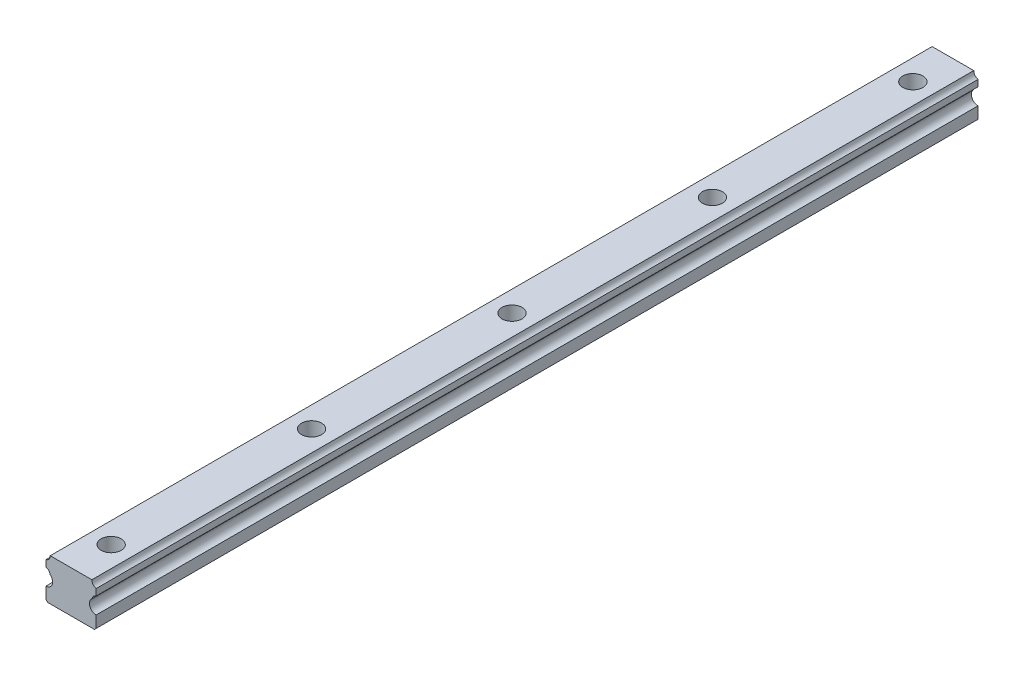
ISO-10303-21;
HEADER;
FILE_DESCRIPTION(('STEP AP214'),'2;1');
FILE_NAME('part.step','',(''),(''),'','','');
FILE_SCHEMA(('AUTOMOTIVE_DESIGN { 1 0 10303 214 1 1 1 1 }'));
ENDSEC;
DATA;
#1=APPLICATION_CONTEXT('core data for automotive mechanical design processes');
#2=APPLICATION_PROTOCOL_DEFINITION('international standard','automotive_design',2000,#1);
#3=PRODUCT_CONTEXT('',#1,'mechanical');
#4=PRODUCT('Part','Part','',(#3));
#5=PRODUCT_RELATED_PRODUCT_CATEGORY('part','',(#4));
#6=PRODUCT_DEFINITION_FORMATION('','',#4);
#7=PRODUCT_DEFINITION_CONTEXT('part definition',#1,'design');
#8=PRODUCT_DEFINITION('design','',#6,#7);
#9=PRODUCT_DEFINITION_SHAPE('','',#8);
#10=(LENGTH_UNIT() NAMED_UNIT(*) SI_UNIT(.MILLI.,.METRE.));
#11=(NAMED_UNIT(*) PLANE_ANGLE_UNIT() SI_UNIT($,.RADIAN.));
#12=(NAMED_UNIT(*) SI_UNIT($,.STERADIAN.) SOLID_ANGLE_UNIT());
#13=UNCERTAINTY_MEASURE_WITH_UNIT(LENGTH_MEASURE(1.E-05),#10,'distance_accuracy_value','');
#14=(GEOMETRIC_REPRESENTATION_CONTEXT(3) GLOBAL_UNCERTAINTY_ASSIGNED_CONTEXT((#13)) GLOBAL_UNIT_ASSIGNED_CONTEXT((#10,
#11,#12)) REPRESENTATION_CONTEXT('',''));
#15=CARTESIAN_POINT('',(0.,0.,0.));
#16=DIRECTION('',(0.,0.,1.));
#17=DIRECTION('',(1.,0.,0.));
#18=AXIS2_PLACEMENT_3D('',#15,#16,#17);
#19=CARTESIAN_POINT('',(0.,10.25,-60.));
#20=DIRECTION('',(0.,-1.,0.));
#21=DIRECTION('',(0.,0.,-1.));
#22=AXIS2_PLACEMENT_3D('',#19,#20,#21);
#23=CYLINDRICAL_SURFACE('',#22,3.);
#24=CARTESIAN_POINT('',(0.,12.5,-60.));
#25=DIRECTION('',(0.,-1.,0.));
#26=DIRECTION('',(0.,0.,-1.));
#27=AXIS2_PLACEMENT_3D('',#24,#25,#26);
#28=CIRCLE('',#27,3.);
#29=CARTESIAN_POINT('',(0.,12.5,-63.));
#30=VERTEX_POINT('',#29);
#31=EDGE_CURVE('E178',#30,#30,#28,.T.);
#32=ORIENTED_EDGE('',*,*,#31,.F.);
#33=EDGE_LOOP('',(#32));
#34=FACE_BOUND('',#33,.T.);
#35=CARTESIAN_POINT('',(0.,8.,-60.));
#36=DIRECTION('',(0.,-1.,0.));
#37=DIRECTION('',(0.,0.,-1.));
#38=AXIS2_PLACEMENT_3D('',#35,#36,#37);
#39=CIRCLE('',#38,3.);
#40=CARTESIAN_POINT('',(0.,8.,-63.));
#41=VERTEX_POINT('',#40);
#42=EDGE_CURVE('E20',#41,#41,#39,.T.);
#43=ORIENTED_EDGE('',*,*,#42,.T.);
#44=EDGE_LOOP('',(#43));
#45=FACE_BOUND('',#44,.T.);
#46=ADVANCED_FACE('F17',(#34,#45),#23,.F.);
#47=CARTESIAN_POINT('',(0.,10.25,0.));
#48=DIRECTION('',(0.,-1.,0.));
#49=DIRECTION('',(0.,0.,-1.));
#50=AXIS2_PLACEMENT_3D('',#47,#48,#49);
#51=CYLINDRICAL_SURFACE('',#50,3.);
#52=CARTESIAN_POINT('',(0.,12.5,0.));
#53=DIRECTION('',(0.,-1.,0.));
#54=DIRECTION('',(0.,0.,-1.));
#55=AXIS2_PLACEMENT_3D('',#52,#53,#54);
#56=CIRCLE('',#55,3.);
#57=CARTESIAN_POINT('',(0.,12.5,-3.));
#58=VERTEX_POINT('',#57);
#59=EDGE_CURVE('E175',#58,#58,#56,.T.);
#60=ORIENTED_EDGE('',*,*,#59,.F.);
#61=EDGE_LOOP('',(#60));
#62=FACE_BOUND('',#61,.T.);
#63=CARTESIAN_POINT('',(0.,8.,0.));
#64=DIRECTION('',(0.,-1.,0.));
#65=DIRECTION('',(0.,0.,-1.));
#66=AXIS2_PLACEMENT_3D('',#63,#64,#65);
#67=CIRCLE('',#66,3.);
#68=CARTESIAN_POINT('',(0.,8.,-3.));
#69=VERTEX_POINT('',#68);
#70=EDGE_CURVE('E190',#69,#69,#67,.T.);
#71=ORIENTED_EDGE('',*,*,#70,.T.);
#72=EDGE_LOOP('',(#71));
#73=FACE_BOUND('',#72,.T.);
#74=ADVANCED_FACE('F314',(#62,#73),#51,.F.);
#75=CARTESIAN_POINT('',(0.,10.25,60.));
#76=DIRECTION('',(0.,-1.,0.));
#77=DIRECTION('',(0.,0.,-1.));
#78=AXIS2_PLACEMENT_3D('',#75,#76,#77);
#79=CYLINDRICAL_SURFACE('',#78,3.);
#80=CARTESIAN_POINT('',(0.,12.5,60.));
#81=DIRECTION('',(0.,-1.,0.));
#82=DIRECTION('',(0.,0.,-1.));
#83=AXIS2_PLACEMENT_3D('',#80,#81,#82);
#84=CIRCLE('',#83,3.);
#85=CARTESIAN_POINT('',(0.,12.5,57.));
#86=VERTEX_POINT('',#85);
#87=EDGE_CURVE('E172',#86,#86,#84,.T.);
#88=ORIENTED_EDGE('',*,*,#87,.F.);
#89=EDGE_LOOP('',(#88));
#90=FACE_BOUND('',#89,.T.);
#91=CARTESIAN_POINT('',(0.,8.,60.));
#92=DIRECTION('',(0.,-1.,0.));
#93=DIRECTION('',(0.,0.,-1.));
#94=AXIS2_PLACEMENT_3D('',#91,#92,#93);
#95=CIRCLE('',#94,3.);
#96=CARTESIAN_POINT('',(0.,8.,57.));
#97=VERTEX_POINT('',#96);
#98=EDGE_CURVE('E188',#97,#97,#95,.T.);
#99=ORIENTED_EDGE('',*,*,#98,.T.);
#100=EDGE_LOOP('',(#99));
#101=FACE_BOUND('',#100,.T.);
#102=ADVANCED_FACE('F312',(#90,#101),#79,.F.);
#103=CARTESIAN_POINT('',(0.,10.25,120.));
#104=DIRECTION('',(0.,-1.,0.));
#105=DIRECTION('',(0.,0.,-1.));
#106=AXIS2_PLACEMENT_3D('',#103,#104,#105);
#107=CYLINDRICAL_SURFACE('',#106,3.);
#108=CARTESIAN_POINT('',(0.,12.5,120.));
#109=DIRECTION('',(0.,-1.,0.));
#110=DIRECTION('',(0.,0.,-1.));
#111=AXIS2_PLACEMENT_3D('',#108,#109,#110);
#112=CIRCLE('',#111,3.);
#113=CARTESIAN_POINT('',(0.,12.5,117.));
#114=VERTEX_POINT('',#113);
#115=EDGE_CURVE('E169',#114,#114,#112,.T.);
#116=ORIENTED_EDGE('',*,*,#115,.F.);
#117=EDGE_LOOP('',(#116));
#118=FACE_BOUND('',#117,.T.);
#119=CARTESIAN_POINT('',(0.,8.,120.));
#120=DIRECTION('',(0.,-1.,0.));
#121=DIRECTION('',(0.,0.,-1.));
#122=AXIS2_PLACEMENT_3D('',#119,#120,#121);
#123=CIRCLE('',#122,3.);
#124=CARTESIAN_POINT('',(0.,8.,117.));
#125=VERTEX_POINT('',#124);
#126=EDGE_CURVE('E185',#125,#125,#123,.T.);
#127=ORIENTED_EDGE('',*,*,#126,.T.);
#128=EDGE_LOOP('',(#127));
#129=FACE_BOUND('',#128,.T.);
#130=ADVANCED_FACE('F212',(#118,#129),#107,.F.);
#131=CARTESIAN_POINT('',(0.,10.25,-120.));
#132=DIRECTION('',(0.,-1.,0.));
#133=DIRECTION('',(0.,0.,-1.));
#134=AXIS2_PLACEMENT_3D('',#131,#132,#133);
#135=CYLINDRICAL_SURFACE('',#134,3.);
#136=CARTESIAN_POINT('',(0.,12.5,-120.));
#137=DIRECTION('',(0.,-1.,0.));
#138=DIRECTION('',(0.,0.,-1.));
#139=AXIS2_PLACEMENT_3D('',#136,#137,#138);
#140=CIRCLE('',#139,3.);
#141=CARTESIAN_POINT('',(0.,12.5,-123.));
#142=VERTEX_POINT('',#141);
#143=EDGE_CURVE('E165',#142,#142,#140,.T.);
#144=ORIENTED_EDGE('',*,*,#143,.F.);
#145=EDGE_LOOP('',(#144));
#146=FACE_BOUND('',#145,.T.);
#147=CARTESIAN_POINT('',(0.,8.,-120.));
#148=DIRECTION('',(0.,-1.,0.));
#149=DIRECTION('',(0.,0.,-1.));
#150=AXIS2_PLACEMENT_3D('',#147,#148,#149);
#151=CIRCLE('',#150,3.);
#152=CARTESIAN_POINT('',(0.,8.,-123.));
#153=VERTEX_POINT('',#152);
#154=EDGE_CURVE('E182',#153,#153,#151,.T.);
#155=ORIENTED_EDGE('',*,*,#154,.T.);
#156=EDGE_LOOP('',(#155));
#157=FACE_BOUND('',#156,.T.);
#158=ADVANCED_FACE('F201',(#146,#157),#135,.F.);
#159=CARTESIAN_POINT('',(0.,8.,-62.375));
#160=DIRECTION('',(0.,-1.,0.));
#161=DIRECTION('',(0.,0.,-1.));
#162=AXIS2_PLACEMENT_3D('',#159,#160,#161);
#163=PLANE('',#162);
#164=CARTESIAN_POINT('',(0.,8.,-60.));
#165=DIRECTION('',(0.,-1.,0.));
#166=DIRECTION('',(0.,0.,-1.));
#167=AXIS2_PLACEMENT_3D('',#164,#165,#166);
#168=CIRCLE('',#167,1.75);
#169=CARTESIAN_POINT('',(0.,8.,-61.75));
#170=VERTEX_POINT('',#169);
#171=EDGE_CURVE('E161',#170,#170,#168,.T.);
#172=ORIENTED_EDGE('',*,*,#171,.T.);
#173=EDGE_LOOP('',(#172));
#174=FACE_BOUND('',#173,.T.);
#175=ORIENTED_EDGE('',*,*,#42,.F.);
#176=EDGE_LOOP('',(#175));
#177=FACE_BOUND('',#176,.T.);
#178=ADVANCED_FACE('F198',(#174,#177),#163,.F.);
#179=CARTESIAN_POINT('',(0.,8.,-2.375));
#180=DIRECTION('',(0.,-1.,0.));
#181=DIRECTION('',(0.,0.,-1.));
#182=AXIS2_PLACEMENT_3D('',#179,#180,#181);
#183=PLANE('',#182);
#184=CARTESIAN_POINT('',(0.,8.,0.));
#185=DIRECTION('',(0.,-1.,0.));
#186=DIRECTION('',(0.,0.,-1.));
#187=AXIS2_PLACEMENT_3D('',#184,#185,#186);
#188=CIRCLE('',#187,1.75);
#189=CARTESIAN_POINT('',(0.,8.,-1.75));
#190=VERTEX_POINT('',#189);
#191=EDGE_CURVE('E158',#190,#190,#188,.T.);
#192=ORIENTED_EDGE('',*,*,#191,.T.);
#193=EDGE_LOOP('',(#192));
#194=FACE_BOUND('',#193,.T.);
#195=ORIENTED_EDGE('',*,*,#70,.F.);
#196=EDGE_LOOP('',(#195));
#197=FACE_BOUND('',#196,.T.);
#198=ADVANCED_FACE('F200',(#194,#197),#183,.F.);
#199=CARTESIAN_POINT('',(0.,8.,57.625));
#200=DIRECTION('',(0.,-1.,0.));
#201=DIRECTION('',(0.,0.,-1.));
#202=AXIS2_PLACEMENT_3D('',#199,#200,#201);
#203=PLANE('',#202);
#204=CARTESIAN_POINT('',(0.,8.,60.));
#205=DIRECTION('',(0.,-1.,0.));
#206=DIRECTION('',(0.,0.,-1.));
#207=AXIS2_PLACEMENT_3D('',#204,#205,#206);
#208=CIRCLE('',#207,1.75);
#209=CARTESIAN_POINT('',(0.,8.,58.25));
#210=VERTEX_POINT('',#209);
#211=EDGE_CURVE('E155',#210,#210,#208,.T.);
#212=ORIENTED_EDGE('',*,*,#211,.T.);
#213=EDGE_LOOP('',(#212));
#214=FACE_BOUND('',#213,.T.);
#215=ORIENTED_EDGE('',*,*,#98,.F.);
#216=EDGE_LOOP('',(#215));
#217=FACE_BOUND('',#216,.T.);
#218=ADVANCED_FACE('F209',(#214,#217),#203,.F.);
#219=CARTESIAN_POINT('',(0.,8.,117.625));
#220=DIRECTION('',(0.,-1.,0.));
#221=DIRECTION('',(0.,0.,-1.));
#222=AXIS2_PLACEMENT_3D('',#219,#220,#221);
#223=PLANE('',#222);
#224=CARTESIAN_POINT('',(0.,8.,120.));
#225=DIRECTION('',(0.,-1.,0.));
#226=DIRECTION('',(0.,0.,-1.));
#227=AXIS2_PLACEMENT_3D('',#224,#225,#226);
#228=CIRCLE('',#227,1.75);
#229=CARTESIAN_POINT('',(0.,8.,118.25));
#230=VERTEX_POINT('',#229);
#231=EDGE_CURVE('E152',#230,#230,#228,.T.);
#232=ORIENTED_EDGE('',*,*,#231,.T.);
#233=EDGE_LOOP('',(#232));
#234=FACE_BOUND('',#233,.T.);
#235=ORIENTED_EDGE('',*,*,#126,.F.);
#236=EDGE_LOOP('',(#235));
#237=FACE_BOUND('',#236,.T.);
#238=ADVANCED_FACE('F299',(#234,#237),#223,.F.);
#239=CARTESIAN_POINT('',(0.,8.,-122.375));
#240=DIRECTION('',(0.,-1.,0.));
#241=DIRECTION('',(0.,0.,-1.));
#242=AXIS2_PLACEMENT_3D('',#239,#240,#241);
#243=PLANE('',#242);
#244=CARTESIAN_POINT('',(0.,8.,-120.));
#245=DIRECTION('',(0.,-1.,0.));
#246=DIRECTION('',(0.,0.,-1.));
#247=AXIS2_PLACEMENT_3D('',#244,#245,#246);
#248=CIRCLE('',#247,1.75);
#249=CARTESIAN_POINT('',(0.,8.,-121.75));
#250=VERTEX_POINT('',#249);
#251=EDGE_CURVE('E149',#250,#250,#248,.T.);
#252=ORIENTED_EDGE('',*,*,#251,.T.);
#253=EDGE_LOOP('',(#252));
#254=FACE_BOUND('',#253,.T.);
#255=ORIENTED_EDGE('',*,*,#154,.F.);
#256=EDGE_LOOP('',(#255));
#257=FACE_BOUND('',#256,.T.);
#258=ADVANCED_FACE('F296',(#254,#257),#243,.F.);
#259=CARTESIAN_POINT('',(7.5,0.5,132.));
#260=DIRECTION('',(1.,0.,0.));
#261=DIRECTION('',(0.,0.,-1.));
#262=AXIS2_PLACEMENT_3D('',#259,#260,#261);
#263=PLANE('',#262);
#264=DIRECTION('',(0.,1.,0.));
#265=VECTOR('',#264,1.);
#266=CARTESIAN_POINT('',(7.5,0.,132.));
#267=LINE('',#266,#265);
#268=CARTESIAN_POINT('',(7.5,0.5,132.));
#269=VERTEX_POINT('',#268);
#270=CARTESIAN_POINT('',(7.5,4.,132.));
#271=VERTEX_POINT('',#270);
#272=EDGE_CURVE('E621',#269,#271,#267,.T.);
#273=ORIENTED_EDGE('',*,*,#272,.F.);
#274=DIRECTION('',(0.,0.,1.));
#275=VECTOR('',#274,1.);
#276=CARTESIAN_POINT('',(7.5,0.5,132.));
#277=LINE('',#276,#275);
#278=CARTESIAN_POINT('',(7.5,0.5,-132.));
#279=VERTEX_POINT('',#278);
#280=EDGE_CURVE('E623',#279,#269,#277,.T.);
#281=ORIENTED_EDGE('',*,*,#280,.F.);
#282=DIRECTION('',(0.,1.,0.));
#283=VECTOR('',#282,1.);
#284=CARTESIAN_POINT('',(7.5,0.,-132.));
#285=LINE('',#284,#283);
#286=CARTESIAN_POINT('',(7.5,4.,-132.));
#287=VERTEX_POINT('',#286);
#288=EDGE_CURVE('E114',#279,#287,#285,.T.);
#289=ORIENTED_EDGE('',*,*,#288,.T.);
#290=DIRECTION('',(0.,0.,1.));
#291=VECTOR('',#290,1.);
#292=CARTESIAN_POINT('',(7.5,4.,132.));
#293=LINE('',#292,#291);
#294=EDGE_CURVE('E125',#287,#271,#293,.T.);
#295=ORIENTED_EDGE('',*,*,#294,.T.);
#296=EDGE_LOOP('',(#273,#281,#289,#295));
#297=FACE_BOUND('',#296,.T.);
#298=ADVANCED_FACE('F293',(#297),#263,.T.);
#299=CARTESIAN_POINT('',(7.5,6.,132.));
#300=DIRECTION('',(0.,0.,1.));
#301=DIRECTION('',(1.,0.,0.));
#302=AXIS2_PLACEMENT_3D('',#299,#300,#301);
#303=CYLINDRICAL_SURFACE('',#302,2.);
#304=DIRECTION('',(0.,0.,1.));
#305=VECTOR('',#304,1.);
#306=CARTESIAN_POINT('',(6.25576432205405,7.56584723958832,132.));
#307=LINE('',#306,#305);
#308=CARTESIAN_POINT('',(6.25576432205405,7.56584723958832,-132.));
#309=VERTEX_POINT('',#308);
#310=CARTESIAN_POINT('',(6.25576432205405,7.56584723958832,132.));
#311=VERTEX_POINT('',#310);
#312=EDGE_CURVE('E123',#309,#311,#307,.T.);
#313=ORIENTED_EDGE('',*,*,#312,.T.);
#314=CARTESIAN_POINT('',(7.5,6.,132.));
#315=DIRECTION('',(0.,0.,1.));
#316=DIRECTION('',(1.,0.,0.));
#317=AXIS2_PLACEMENT_3D('',#314,#315,#316);
#318=CIRCLE('',#317,2.);
#319=EDGE_CURVE('E625',#271,#311,#318,.F.);
#320=ORIENTED_EDGE('',*,*,#319,.F.);
#321=ORIENTED_EDGE('',*,*,#294,.F.);
#322=CARTESIAN_POINT('',(7.5,6.,-132.));
#323=DIRECTION('',(0.,0.,1.));
#324=DIRECTION('',(1.,0.,0.));
#325=AXIS2_PLACEMENT_3D('',#322,#323,#324);
#326=CIRCLE('',#325,2.);
#327=EDGE_CURVE('E119',#287,#309,#326,.F.);
#328=ORIENTED_EDGE('',*,*,#327,.T.);
#329=EDGE_LOOP('',(#313,#320,#321,#328));
#330=FACE_BOUND('',#329,.T.);
#331=ADVANCED_FACE('F121',(#330),#303,.F.);
#332=CARTESIAN_POINT('',(7.93,7.271,132.));
#333=DIRECTION('',(0.,0.,1.));
#334=DIRECTION('',(1.,0.,0.));
#335=AXIS2_PLACEMENT_3D('',#332,#333,#334);
#336=CYLINDRICAL_SURFACE('',#335,1.7);
#337=DIRECTION('',(0.,0.,-1.));
#338=VECTOR('',#337,1.);
#339=CARTESIAN_POINT('',(7.5,8.91571882095391,132.));
#340=LINE('',#339,#338);
#341=CARTESIAN_POINT('',(7.5,8.91571882095391,132.));
#342=VERTEX_POINT('',#341);
#343=CARTESIAN_POINT('',(7.5,8.91571882095391,-132.));
#344=VERTEX_POINT('',#343);
#345=EDGE_CURVE('E136',#342,#344,#340,.T.);
#346=ORIENTED_EDGE('',*,*,#345,.F.);
#347=CARTESIAN_POINT('',(7.93,7.271,132.));
#348=DIRECTION('',(0.,0.,1.));
#349=DIRECTION('',(1.,0.,0.));
#350=AXIS2_PLACEMENT_3D('',#347,#348,#349);
#351=CIRCLE('',#350,1.7);
#352=EDGE_CURVE('E134',#311,#342,#351,.F.);
#353=ORIENTED_EDGE('',*,*,#352,.F.);
#354=ORIENTED_EDGE('',*,*,#312,.F.);
#355=CARTESIAN_POINT('',(7.93,7.271,-132.));
#356=DIRECTION('',(0.,0.,1.));
#357=DIRECTION('',(1.,0.,0.));
#358=AXIS2_PLACEMENT_3D('',#355,#356,#357);
#359=CIRCLE('',#358,1.7);
#360=EDGE_CURVE('E128',#309,#344,#359,.F.);
#361=ORIENTED_EDGE('',*,*,#360,.T.);
#362=EDGE_LOOP('',(#346,#353,#354,#361));
#363=FACE_BOUND('',#362,.T.);
#364=ADVANCED_FACE('F131',(#363),#336,.F.);
#365=CARTESIAN_POINT('',(7.5,8.91571882095391,132.));
#366=DIRECTION('',(1.,0.,0.));
#367=DIRECTION('',(0.,0.,-1.));
#368=AXIS2_PLACEMENT_3D('',#365,#366,#367);
#369=PLANE('',#368);
#370=DIRECTION('',(0.,1.,0.));
#371=VECTOR('',#370,1.);
#372=CARTESIAN_POINT('',(7.5,0.,132.));
#373=LINE('',#372,#371);
#374=CARTESIAN_POINT('',(7.5,10.8552811790461,132.));
#375=VERTEX_POINT('',#374);
#376=EDGE_CURVE('E691',#342,#375,#373,.T.);
#377=ORIENTED_EDGE('',*,*,#376,.F.);
#378=ORIENTED_EDGE('',*,*,#345,.T.);
#379=DIRECTION('',(0.,1.,0.));
#380=VECTOR('',#379,1.);
#381=CARTESIAN_POINT('',(7.5,0.,-132.));
#382=LINE('',#381,#380);
#383=CARTESIAN_POINT('',(7.5,10.8552811790461,-132.));
#384=VERTEX_POINT('',#383);
#385=EDGE_CURVE('E142',#344,#384,#382,.T.);
#386=ORIENTED_EDGE('',*,*,#385,.T.);
#387=DIRECTION('',(0.,0.,1.));
#388=VECTOR('',#387,1.);
#389=CARTESIAN_POINT('',(7.5,10.8552811790461,132.));
#390=LINE('',#389,#388);
#391=EDGE_CURVE('E181',#384,#375,#390,.T.);
#392=ORIENTED_EDGE('',*,*,#391,.T.);
#393=EDGE_LOOP('',(#377,#378,#386,#392));
#394=FACE_BOUND('',#393,.T.);
#395=ADVANCED_FACE('F284',(#394),#369,.T.);
#396=CARTESIAN_POINT('',(7.93,12.5,132.));
#397=DIRECTION('',(0.,0.,1.));
#398=DIRECTION('',(1.,0.,0.));
#399=AXIS2_PLACEMENT_3D('',#396,#397,#398);
#400=CYLINDRICAL_SURFACE('',#399,1.7);
#401=DIRECTION('',(0.,0.,1.));
#402=VECTOR('',#401,1.);
#403=CARTESIAN_POINT('',(6.23,12.5,132.));
#404=LINE('',#403,#402);
#405=CARTESIAN_POINT('',(6.23,12.5,132.));
#406=VERTEX_POINT('',#405);
#407=CARTESIAN_POINT('',(6.23,12.5,-132.));
#408=VERTEX_POINT('',#407);
#409=EDGE_CURVE('E168',#406,#408,#404,.F.);
#410=ORIENTED_EDGE('',*,*,#409,.F.);
#411=CARTESIAN_POINT('',(7.93,12.5,132.));
#412=DIRECTION('',(0.,0.,1.));
#413=DIRECTION('',(1.,0.,0.));
#414=AXIS2_PLACEMENT_3D('',#411,#412,#413);
#415=CIRCLE('',#414,1.7);
#416=EDGE_CURVE('E688',#375,#406,#415,.F.);
#417=ORIENTED_EDGE('',*,*,#416,.F.);
#418=ORIENTED_EDGE('',*,*,#391,.F.);
#419=CARTESIAN_POINT('',(7.93,12.5,-132.));
#420=DIRECTION('',(0.,0.,1.));
#421=DIRECTION('',(1.,0.,0.));
#422=AXIS2_PLACEMENT_3D('',#419,#420,#421);
#423=CIRCLE('',#422,1.7);
#424=EDGE_CURVE('E144',#384,#408,#423,.F.);
#425=ORIENTED_EDGE('',*,*,#424,.T.);
#426=EDGE_LOOP('',(#410,#417,#418,#425));
#427=FACE_BOUND('',#426,.T.);
#428=ADVANCED_FACE('F280',(#427),#400,.F.);
#429=CARTESIAN_POINT('',(6.23,12.5,132.));
#430=DIRECTION('',(0.,1.,0.));
#431=DIRECTION('',(0.,0.,1.));
#432=AXIS2_PLACEMENT_3D('',#429,#430,#431);
#433=PLANE('',#432);
#434=DIRECTION('',(1.,0.,0.));
#435=VECTOR('',#434,1.);
#436=CARTESIAN_POINT('',(0.,12.5,132.));
#437=LINE('',#436,#435);
#438=CARTESIAN_POINT('',(-6.23000000000001,12.5,132.));
#439=VERTEX_POINT('',#438);
#440=EDGE_CURVE('E687',#406,#439,#437,.F.);
#441=ORIENTED_EDGE('',*,*,#440,.F.);
#442=ORIENTED_EDGE('',*,*,#409,.T.);
#443=DIRECTION('',(1.,0.,0.));
#444=VECTOR('',#443,1.);
#445=CARTESIAN_POINT('',(0.,12.5,-132.));
#446=LINE('',#445,#444);
#447=CARTESIAN_POINT('',(-6.23000000000001,12.5,-132.));
#448=VERTEX_POINT('',#447);
#449=EDGE_CURVE('E699',#408,#448,#446,.F.);
#450=ORIENTED_EDGE('',*,*,#449,.T.);
#451=DIRECTION('',(0.,0.,1.));
#452=VECTOR('',#451,1.);
#453=CARTESIAN_POINT('',(-6.23000000000001,12.5,132.));
#454=LINE('',#453,#452);
#455=EDGE_CURVE('E727',#448,#439,#454,.T.);
#456=ORIENTED_EDGE('',*,*,#455,.T.);
#457=EDGE_LOOP('',(#441,#442,#450,#456));
#458=FACE_BOUND('',#457,.T.);
#459=ORIENTED_EDGE('',*,*,#143,.T.);
#460=EDGE_LOOP('',(#459));
#461=FACE_BOUND('',#460,.T.);
#462=ORIENTED_EDGE('',*,*,#115,.T.);
#463=EDGE_LOOP('',(#462));
#464=FACE_BOUND('',#463,.T.);
#465=ORIENTED_EDGE('',*,*,#87,.T.);
#466=EDGE_LOOP('',(#465));
#467=FACE_BOUND('',#466,.T.);
#468=ORIENTED_EDGE('',*,*,#59,.T.);
#469=EDGE_LOOP('',(#468));
#470=FACE_BOUND('',#469,.T.);
#471=ORIENTED_EDGE('',*,*,#31,.T.);
#472=EDGE_LOOP('',(#471));
#473=FACE_BOUND('',#472,.T.);
#474=ADVANCED_FACE('F276',(#458,#461,#464,#467,#470,#473),#433,.T.);
#475=CARTESIAN_POINT('',(-7.93,12.5,132.));
#476=DIRECTION('',(0.,0.,1.));
#477=DIRECTION('',(1.,0.,0.));
#478=AXIS2_PLACEMENT_3D('',#475,#476,#477);
#479=CYLINDRICAL_SURFACE('',#478,1.69999999999999);
#480=DIRECTION('',(0.,0.,1.));
#481=VECTOR('',#480,1.);
#482=CARTESIAN_POINT('',(-7.5,10.8552811790461,132.));
#483=LINE('',#482,#481);
#484=CARTESIAN_POINT('',(-7.5,10.8552811790461,132.));
#485=VERTEX_POINT('',#484);
#486=CARTESIAN_POINT('',(-7.5,10.8552811790461,-132.));
#487=VERTEX_POINT('',#486);
#488=EDGE_CURVE('E725',#485,#487,#483,.F.);
#489=ORIENTED_EDGE('',*,*,#488,.F.);
#490=CARTESIAN_POINT('',(-7.93,12.5,132.));
#491=DIRECTION('',(0.,0.,1.));
#492=DIRECTION('',(1.,0.,0.));
#493=AXIS2_PLACEMENT_3D('',#490,#491,#492);
#494=CIRCLE('',#493,1.69999999999999);
#495=EDGE_CURVE('E684',#439,#485,#494,.F.);
#496=ORIENTED_EDGE('',*,*,#495,.F.);
#497=ORIENTED_EDGE('',*,*,#455,.F.);
#498=CARTESIAN_POINT('',(-7.93,12.5,-132.));
#499=DIRECTION('',(0.,0.,1.));
#500=DIRECTION('',(1.,0.,0.));
#501=AXIS2_PLACEMENT_3D('',#498,#499,#500);
#502=CIRCLE('',#501,1.69999999999999);
#503=EDGE_CURVE('E698',#448,#487,#502,.F.);
#504=ORIENTED_EDGE('',*,*,#503,.T.);
#505=EDGE_LOOP('',(#489,#496,#497,#504));
#506=FACE_BOUND('',#505,.T.);
#507=ADVANCED_FACE('F272',(#506),#479,.F.);
#508=CARTESIAN_POINT('',(-7.5,10.8552811790461,132.));
#509=DIRECTION('',(-1.,0.,0.));
#510=DIRECTION('',(0.,0.,1.));
#511=AXIS2_PLACEMENT_3D('',#508,#509,#510);
#512=PLANE('',#511);
#513=DIRECTION('',(0.,1.,0.));
#514=VECTOR('',#513,1.);
#515=CARTESIAN_POINT('',(-7.5,0.,132.));
#516=LINE('',#515,#514);
#517=CARTESIAN_POINT('',(-7.5,8.9157188209539,132.));
#518=VERTEX_POINT('',#517);
#519=EDGE_CURVE('E683',#485,#518,#516,.F.);
#520=ORIENTED_EDGE('',*,*,#519,.F.);
#521=ORIENTED_EDGE('',*,*,#488,.T.);
#522=DIRECTION('',(0.,1.,0.));
#523=VECTOR('',#522,1.);
#524=CARTESIAN_POINT('',(-7.5,0.,-132.));
#525=LINE('',#524,#523);
#526=CARTESIAN_POINT('',(-7.5,8.9157188209539,-132.));
#527=VERTEX_POINT('',#526);
#528=EDGE_CURVE('E697',#487,#527,#525,.F.);
#529=ORIENTED_EDGE('',*,*,#528,.T.);
#530=DIRECTION('',(0.,0.,1.));
#531=VECTOR('',#530,1.);
#532=CARTESIAN_POINT('',(-7.5,8.9157188209539,132.));
#533=LINE('',#532,#531);
#534=EDGE_CURVE('E723',#527,#518,#533,.T.);
#535=ORIENTED_EDGE('',*,*,#534,.T.);
#536=EDGE_LOOP('',(#520,#521,#529,#535));
#537=FACE_BOUND('',#536,.T.);
#538=ADVANCED_FACE('F268',(#537),#512,.T.);
#539=CARTESIAN_POINT('',(-7.93,7.271,132.));
#540=DIRECTION('',(0.,0.,1.));
#541=DIRECTION('',(1.,0.,0.));
#542=AXIS2_PLACEMENT_3D('',#539,#540,#541);
#543=CYLINDRICAL_SURFACE('',#542,1.7);
#544=DIRECTION('',(0.,0.,1.));
#545=VECTOR('',#544,1.);
#546=CARTESIAN_POINT('',(-6.25576432205405,7.56584723958832,132.));
#547=LINE('',#546,#545);
#548=CARTESIAN_POINT('',(-6.25576432205405,7.56584723958832,-132.));
#549=VERTEX_POINT('',#548);
#550=CARTESIAN_POINT('',(-6.25576432205405,7.56584723958832,132.));
#551=VERTEX_POINT('',#550);
#552=EDGE_CURVE('E714',#549,#551,#547,.T.);
#553=ORIENTED_EDGE('',*,*,#552,.T.);
#554=CARTESIAN_POINT('',(-7.93,7.271,132.));
#555=DIRECTION('',(0.,0.,1.));
#556=DIRECTION('',(1.,0.,0.));
#557=AXIS2_PLACEMENT_3D('',#554,#555,#556);
#558=CIRCLE('',#557,1.7);
#559=EDGE_CURVE('E680',#518,#551,#558,.F.);
#560=ORIENTED_EDGE('',*,*,#559,.F.);
#561=ORIENTED_EDGE('',*,*,#534,.F.);
#562=CARTESIAN_POINT('',(-7.93,7.271,-132.));
#563=DIRECTION('',(0.,0.,1.));
#564=DIRECTION('',(1.,0.,0.));
#565=AXIS2_PLACEMENT_3D('',#562,#563,#564);
#566=CIRCLE('',#565,1.7);
#567=EDGE_CURVE('E696',#527,#549,#566,.F.);
#568=ORIENTED_EDGE('',*,*,#567,.T.);
#569=EDGE_LOOP('',(#553,#560,#561,#568));
#570=FACE_BOUND('',#569,.T.);
#571=ADVANCED_FACE('F264',(#570),#543,.F.);
#572=CARTESIAN_POINT('',(-7.5,6.,132.));
#573=DIRECTION('',(0.,0.,1.));
#574=DIRECTION('',(1.,0.,0.));
#575=AXIS2_PLACEMENT_3D('',#572,#573,#574);
#576=CYLINDRICAL_SURFACE('',#575,2.);
#577=DIRECTION('',(0.,0.,1.));
#578=VECTOR('',#577,1.);
#579=CARTESIAN_POINT('',(-7.5,4.,132.));
#580=LINE('',#579,#578);
#581=CARTESIAN_POINT('',(-7.5,4.,132.));
#582=VERTEX_POINT('',#581);
#583=CARTESIAN_POINT('',(-7.5,4.,-132.));
#584=VERTEX_POINT('',#583);
#585=EDGE_CURVE('E164',#582,#584,#580,.F.);
#586=ORIENTED_EDGE('',*,*,#585,.F.);
#587=CARTESIAN_POINT('',(-7.5,6.,132.));
#588=DIRECTION('',(0.,0.,1.));
#589=DIRECTION('',(1.,0.,0.));
#590=AXIS2_PLACEMENT_3D('',#587,#588,#589);
#591=CIRCLE('',#590,2.);
#592=EDGE_CURVE('E678',#551,#582,#591,.F.);
#593=ORIENTED_EDGE('',*,*,#592,.F.);
#594=ORIENTED_EDGE('',*,*,#552,.F.);
#595=CARTESIAN_POINT('',(-7.5,6.,-132.));
#596=DIRECTION('',(0.,0.,1.));
#597=DIRECTION('',(1.,0.,0.));
#598=AXIS2_PLACEMENT_3D('',#595,#596,#597);
#599=CIRCLE('',#598,2.);
#600=EDGE_CURVE('E694',#549,#584,#599,.F.);
#601=ORIENTED_EDGE('',*,*,#600,.T.);
#602=EDGE_LOOP('',(#586,#593,#594,#601));
#603=FACE_BOUND('',#602,.T.);
#604=ADVANCED_FACE('F260',(#603),#576,.F.);
#605=CARTESIAN_POINT('',(-7.5,4.,132.));
#606=DIRECTION('',(-1.,0.,0.));
#607=DIRECTION('',(0.,0.,1.));
#608=AXIS2_PLACEMENT_3D('',#605,#606,#607);
#609=PLANE('',#608);
#610=DIRECTION('',(0.,1.,0.));
#611=VECTOR('',#610,1.);
#612=CARTESIAN_POINT('',(-7.5,0.,132.));
#613=LINE('',#612,#611);
#614=CARTESIAN_POINT('',(-7.5,0.5,132.));
#615=VERTEX_POINT('',#614);
#616=EDGE_CURVE('E660',#582,#615,#613,.F.);
#617=ORIENTED_EDGE('',*,*,#616,.F.);
#618=ORIENTED_EDGE('',*,*,#585,.T.);
#619=DIRECTION('',(0.,1.,0.));
#620=VECTOR('',#619,1.);
#621=CARTESIAN_POINT('',(-7.5,0.,-132.));
#622=LINE('',#621,#620);
#623=CARTESIAN_POINT('',(-7.5,0.5,-132.));
#624=VERTEX_POINT('',#623);
#625=EDGE_CURVE('E649',#584,#624,#622,.F.);
#626=ORIENTED_EDGE('',*,*,#625,.T.);
#627=DIRECTION('',(0.,0.,1.));
#628=VECTOR('',#627,1.);
#629=CARTESIAN_POINT('',(-7.5,0.5,132.));
#630=LINE('',#629,#628);
#631=EDGE_CURVE('E677',#615,#624,#630,.F.);
#632=ORIENTED_EDGE('',*,*,#631,.F.);
#633=EDGE_LOOP('',(#617,#618,#626,#632));
#634=FACE_BOUND('',#633,.T.);
#635=ADVANCED_FACE('F256',(#634),#609,.T.);
#636=CARTESIAN_POINT('',(0.,4.,-60.));
#637=DIRECTION('',(0.,-1.,0.));
#638=DIRECTION('',(0.,0.,-1.));
#639=AXIS2_PLACEMENT_3D('',#636,#637,#638);
#640=CYLINDRICAL_SURFACE('',#639,1.75);
#641=CARTESIAN_POINT('',(0.,0.,-60.));
#642=DIRECTION('',(0.,-1.,0.));
#643=DIRECTION('',(0.,0.,-1.));
#644=AXIS2_PLACEMENT_3D('',#641,#642,#643);
#645=CIRCLE('',#644,1.75);
#646=CARTESIAN_POINT('',(0.,0.,-61.75));
#647=VERTEX_POINT('',#646);
#648=EDGE_CURVE('E674',#647,#647,#645,.F.);
#649=ORIENTED_EDGE('',*,*,#648,.F.);
#650=EDGE_LOOP('',(#649));
#651=FACE_BOUND('',#650,.T.);
#652=ORIENTED_EDGE('',*,*,#171,.F.);
#653=EDGE_LOOP('',(#652));
#654=FACE_BOUND('',#653,.T.);
#655=ADVANCED_FACE('F252',(#651,#654),#640,.F.);
#656=CARTESIAN_POINT('',(0.,4.,0.));
#657=DIRECTION('',(0.,-1.,0.));
#658=DIRECTION('',(0.,0.,-1.));
#659=AXIS2_PLACEMENT_3D('',#656,#657,#658);
#660=CYLINDRICAL_SURFACE('',#659,1.75);
#661=CARTESIAN_POINT('',(0.,0.,0.));
#662=DIRECTION('',(0.,-1.,0.));
#663=DIRECTION('',(0.,0.,-1.));
#664=AXIS2_PLACEMENT_3D('',#661,#662,#663);
#665=CIRCLE('',#664,1.75);
#666=CARTESIAN_POINT('',(0.,0.,-1.75));
#667=VERTEX_POINT('',#666);
#668=EDGE_CURVE('E671',#667,#667,#665,.F.);
#669=ORIENTED_EDGE('',*,*,#668,.F.);
#670=EDGE_LOOP('',(#669));
#671=FACE_BOUND('',#670,.T.);
#672=ORIENTED_EDGE('',*,*,#191,.F.);
#673=EDGE_LOOP('',(#672));
#674=FACE_BOUND('',#673,.T.);
#675=ADVANCED_FACE('F248',(#671,#674),#660,.F.);
#676=CARTESIAN_POINT('',(0.,4.,60.));
#677=DIRECTION('',(0.,-1.,0.));
#678=DIRECTION('',(0.,0.,-1.));
#679=AXIS2_PLACEMENT_3D('',#676,#677,#678);
#680=CYLINDRICAL_SURFACE('',#679,1.75);
#681=CARTESIAN_POINT('',(0.,0.,60.));
#682=DIRECTION('',(0.,-1.,0.));
#683=DIRECTION('',(0.,0.,-1.));
#684=AXIS2_PLACEMENT_3D('',#681,#682,#683);
#685=CIRCLE('',#684,1.75);
#686=CARTESIAN_POINT('',(0.,0.,58.25));
#687=VERTEX_POINT('',#686);
#688=EDGE_CURVE('E668',#687,#687,#685,.F.);
#689=ORIENTED_EDGE('',*,*,#688,.F.);
#690=EDGE_LOOP('',(#689));
#691=FACE_BOUND('',#690,.T.);
#692=ORIENTED_EDGE('',*,*,#211,.F.);
#693=EDGE_LOOP('',(#692));
#694=FACE_BOUND('',#693,.T.);
#695=ADVANCED_FACE('F244',(#691,#694),#680,.F.);
#696=CARTESIAN_POINT('',(0.,4.,120.));
#697=DIRECTION('',(0.,-1.,0.));
#698=DIRECTION('',(0.,0.,-1.));
#699=AXIS2_PLACEMENT_3D('',#696,#697,#698);
#700=CYLINDRICAL_SURFACE('',#699,1.75);
#701=CARTESIAN_POINT('',(0.,0.,120.));
#702=DIRECTION('',(0.,-1.,0.));
#703=DIRECTION('',(0.,0.,-1.));
#704=AXIS2_PLACEMENT_3D('',#701,#702,#703);
#705=CIRCLE('',#704,1.75);
#706=CARTESIAN_POINT('',(0.,0.,118.25));
#707=VERTEX_POINT('',#706);
#708=EDGE_CURVE('E665',#707,#707,#705,.F.);
#709=ORIENTED_EDGE('',*,*,#708,.F.);
#710=EDGE_LOOP('',(#709));
#711=FACE_BOUND('',#710,.T.);
#712=ORIENTED_EDGE('',*,*,#231,.F.);
#713=EDGE_LOOP('',(#712));
#714=FACE_BOUND('',#713,.T.);
#715=ADVANCED_FACE('F240',(#711,#714),#700,.F.);
#716=CARTESIAN_POINT('',(0.,4.,-120.));
#717=DIRECTION('',(0.,-1.,0.));
#718=DIRECTION('',(0.,0.,-1.));
#719=AXIS2_PLACEMENT_3D('',#716,#717,#718);
#720=CYLINDRICAL_SURFACE('',#719,1.75);
#721=CARTESIAN_POINT('',(0.,0.,-120.));
#722=DIRECTION('',(0.,-1.,0.));
#723=DIRECTION('',(0.,0.,-1.));
#724=AXIS2_PLACEMENT_3D('',#721,#722,#723);
#725=CIRCLE('',#724,1.75);
#726=CARTESIAN_POINT('',(0.,0.,-121.75));
#727=VERTEX_POINT('',#726);
#728=EDGE_CURVE('E654',#727,#727,#725,.F.);
#729=ORIENTED_EDGE('',*,*,#728,.F.);
#730=EDGE_LOOP('',(#729));
#731=FACE_BOUND('',#730,.T.);
#732=ORIENTED_EDGE('',*,*,#251,.F.);
#733=EDGE_LOOP('',(#732));
#734=FACE_BOUND('',#733,.T.);
#735=ADVANCED_FACE('F237',(#731,#734),#720,.F.);
#736=CARTESIAN_POINT('',(0.,0.,-132.));
#737=DIRECTION('',(0.,0.,1.));
#738=DIRECTION('',(1.,0.,0.));
#739=AXIS2_PLACEMENT_3D('',#736,#737,#738);
#740=PLANE('',#739);
#741=DIRECTION('',(0.707106781186548,-0.707106781186548,0.));
#742=VECTOR('',#741,1.);
#743=CARTESIAN_POINT('',(-7.5,0.5,-132.));
#744=LINE('',#743,#742);
#745=CARTESIAN_POINT('',(-7.,0.,-132.));
#746=VERTEX_POINT('',#745);
#747=EDGE_CURVE('E657',#624,#746,#744,.T.);
#748=ORIENTED_EDGE('',*,*,#747,.F.);
#749=ORIENTED_EDGE('',*,*,#625,.F.);
#750=ORIENTED_EDGE('',*,*,#600,.F.);
#751=ORIENTED_EDGE('',*,*,#567,.F.);
#752=ORIENTED_EDGE('',*,*,#528,.F.);
#753=ORIENTED_EDGE('',*,*,#503,.F.);
#754=ORIENTED_EDGE('',*,*,#449,.F.);
#755=ORIENTED_EDGE('',*,*,#424,.F.);
#756=ORIENTED_EDGE('',*,*,#385,.F.);
#757=ORIENTED_EDGE('',*,*,#360,.F.);
#758=ORIENTED_EDGE('',*,*,#327,.F.);
#759=ORIENTED_EDGE('',*,*,#288,.F.);
#760=DIRECTION('',(0.707106781186548,0.707106781186548,0.));
#761=VECTOR('',#760,1.);
#762=CARTESIAN_POINT('',(7.,0.,-132.));
#763=LINE('',#762,#761);
#764=CARTESIAN_POINT('',(7.,0.,-132.));
#765=VERTEX_POINT('',#764);
#766=EDGE_CURVE('E632',#765,#279,#763,.T.);
#767=ORIENTED_EDGE('',*,*,#766,.F.);
#768=DIRECTION('',(1.,0.,0.));
#769=VECTOR('',#768,1.);
#770=CARTESIAN_POINT('',(-7.,0.,-132.));
#771=LINE('',#770,#769);
#772=EDGE_CURVE('E645',#746,#765,#771,.T.);
#773=ORIENTED_EDGE('',*,*,#772,.F.);
#774=EDGE_LOOP('',(#748,#749,#750,#751,#752,#753,#754,#755,#756,#757,#758,#759,#767,#773));
#775=FACE_BOUND('',#774,.T.);
#776=ADVANCED_FACE('F140',(#775),#740,.F.);
#777=CARTESIAN_POINT('',(7.,0.,132.));
#778=DIRECTION('',(0.707106781186548,-0.707106781186548,0.));
#779=DIRECTION('',(0.707106781186548,0.707106781186548,0.));
#780=AXIS2_PLACEMENT_3D('',#777,#778,#779);
#781=PLANE('',#780);
#782=DIRECTION('',(0.707106781186547,0.707106781186548,0.));
#783=VECTOR('',#782,1.);
#784=CARTESIAN_POINT('',(7.,0.,132.));
#785=LINE('',#784,#783);
#786=CARTESIAN_POINT('',(7.,0.,132.));
#787=VERTEX_POINT('',#786);
#788=EDGE_CURVE('E626',#787,#269,#785,.T.);
#789=ORIENTED_EDGE('',*,*,#788,.F.);
#790=DIRECTION('',(0.,0.,-1.));
#791=VECTOR('',#790,1.);
#792=CARTESIAN_POINT('',(7.,0.,132.));
#793=LINE('',#792,#791);
#794=EDGE_CURVE('E641',#765,#787,#793,.F.);
#795=ORIENTED_EDGE('',*,*,#794,.F.);
#796=ORIENTED_EDGE('',*,*,#766,.T.);
#797=ORIENTED_EDGE('',*,*,#280,.T.);
#798=EDGE_LOOP('',(#789,#795,#796,#797));
#799=FACE_BOUND('',#798,.T.);
#800=ADVANCED_FACE('F231',(#799),#781,.T.);
#801=CARTESIAN_POINT('',(0.,0.,132.));
#802=DIRECTION('',(0.,0.,1.));
#803=DIRECTION('',(1.,0.,0.));
#804=AXIS2_PLACEMENT_3D('',#801,#802,#803);
#805=PLANE('',#804);
#806=ORIENTED_EDGE('',*,*,#592,.T.);
#807=ORIENTED_EDGE('',*,*,#616,.T.);
#808=DIRECTION('',(0.707106781186548,-0.707106781186548,0.));
#809=VECTOR('',#808,1.);
#810=CARTESIAN_POINT('',(-7.5,0.5,132.));
#811=LINE('',#810,#809);
#812=CARTESIAN_POINT('',(-7.,0.,132.));
#813=VERTEX_POINT('',#812);
#814=EDGE_CURVE('E35',#813,#615,#811,.F.);
#815=ORIENTED_EDGE('',*,*,#814,.F.);
#816=DIRECTION('',(1.,0.,0.));
#817=VECTOR('',#816,1.);
#818=CARTESIAN_POINT('',(-7.,0.,132.));
#819=LINE('',#818,#817);
#820=EDGE_CURVE('E26',#787,#813,#819,.F.);
#821=ORIENTED_EDGE('',*,*,#820,.F.);
#822=ORIENTED_EDGE('',*,*,#788,.T.);
#823=ORIENTED_EDGE('',*,*,#272,.T.);
#824=ORIENTED_EDGE('',*,*,#319,.T.);
#825=ORIENTED_EDGE('',*,*,#352,.T.);
#826=ORIENTED_EDGE('',*,*,#376,.T.);
#827=ORIENTED_EDGE('',*,*,#416,.T.);
#828=ORIENTED_EDGE('',*,*,#440,.T.);
#829=ORIENTED_EDGE('',*,*,#495,.T.);
#830=ORIENTED_EDGE('',*,*,#519,.T.);
#831=ORIENTED_EDGE('',*,*,#559,.T.);
#832=EDGE_LOOP('',(#806,#807,#815,#821,#822,#823,#824,#825,#826,#827,#828,#829,#830,#831));
#833=FACE_BOUND('',#832,.T.);
#834=ADVANCED_FACE('F223',(#833),#805,.T.);
#835=CARTESIAN_POINT('',(-7.5,0.5,132.));
#836=DIRECTION('',(-0.707106781186548,-0.707106781186548,0.));
#837=DIRECTION('',(0.707106781186548,-0.707106781186548,0.));
#838=AXIS2_PLACEMENT_3D('',#835,#836,#837);
#839=PLANE('',#838);
#840=ORIENTED_EDGE('',*,*,#814,.T.);
#841=ORIENTED_EDGE('',*,*,#631,.T.);
#842=ORIENTED_EDGE('',*,*,#747,.T.);
#843=DIRECTION('',(0.,0.,-1.));
#844=VECTOR('',#843,1.);
#845=CARTESIAN_POINT('',(-7.,0.,132.));
#846=LINE('',#845,#844);
#847=EDGE_CURVE('E11',#813,#746,#846,.T.);
#848=ORIENTED_EDGE('',*,*,#847,.F.);
#849=EDGE_LOOP('',(#840,#841,#842,#848));
#850=FACE_BOUND('',#849,.T.);
#851=ADVANCED_FACE('F217',(#850),#839,.T.);
#852=CARTESIAN_POINT('',(-7.,0.,132.));
#853=DIRECTION('',(0.,-1.,0.));
#854=DIRECTION('',(0.,0.,-1.));
#855=AXIS2_PLACEMENT_3D('',#852,#853,#854);
#856=PLANE('',#855);
#857=ORIENTED_EDGE('',*,*,#820,.T.);
#858=ORIENTED_EDGE('',*,*,#847,.T.);
#859=ORIENTED_EDGE('',*,*,#772,.T.);
#860=ORIENTED_EDGE('',*,*,#794,.T.);
#861=EDGE_LOOP('',(#857,#858,#859,#860));
#862=FACE_BOUND('',#861,.T.);
#863=ORIENTED_EDGE('',*,*,#728,.T.);
#864=EDGE_LOOP('',(#863));
#865=FACE_BOUND('',#864,.T.);
#866=ORIENTED_EDGE('',*,*,#708,.T.);
#867=EDGE_LOOP('',(#866));
#868=FACE_BOUND('',#867,.T.);
#869=ORIENTED_EDGE('',*,*,#688,.T.);
#870=EDGE_LOOP('',(#869));
#871=FACE_BOUND('',#870,.T.);
#872=ORIENTED_EDGE('',*,*,#668,.T.);
#873=EDGE_LOOP('',(#872));
#874=FACE_BOUND('',#873,.T.);
#875=ORIENTED_EDGE('',*,*,#648,.T.);
#876=EDGE_LOOP('',(#875));
#877=FACE_BOUND('',#876,.T.);
#878=ADVANCED_FACE('F215',(#862,#865,#868,#871,#874,#877),#856,.T.);
#879=CLOSED_SHELL('',(#46,#74,#102,#130,#158,#178,#198,#218,#238,#258,#298,#331,#364,#395,#428,
#474,#507,#538,#571,#604,#635,#655,#675,#695,#715,#735,#776,#800,#834,#851,#878));
#880=MANIFOLD_SOLID_BREP('B1',#879);
#881=ADVANCED_BREP_SHAPE_REPRESENTATION('',(#18,#880),#14);
#882=SHAPE_DEFINITION_REPRESENTATION(#9,#881);
ENDSEC;
END-ISO-10303-21;
